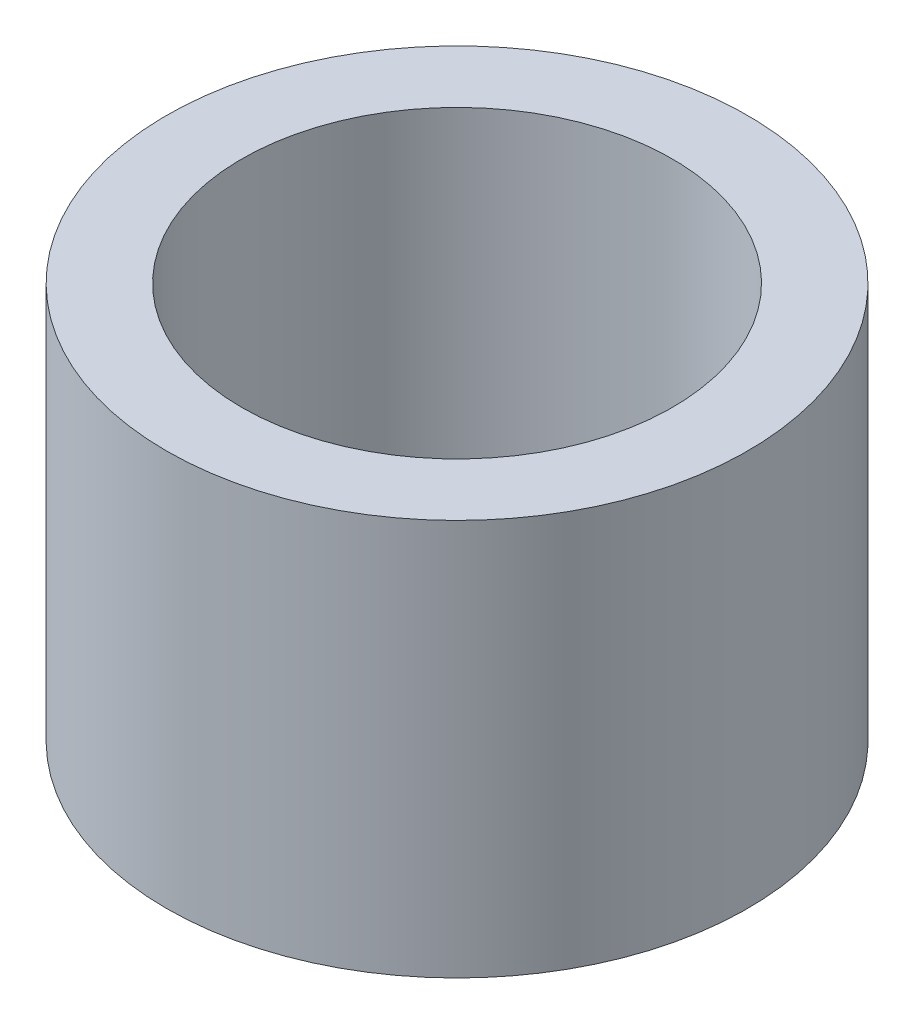
ISO-10303-21;
HEADER;
FILE_DESCRIPTION(('STEP AP214'),'2;1');
FILE_NAME('part.step','',(''),(''),'','','');
FILE_SCHEMA(('AUTOMOTIVE_DESIGN { 1 0 10303 214 1 1 1 1 }'));
ENDSEC;
DATA;
#1=APPLICATION_CONTEXT('core data for automotive mechanical design processes');
#2=APPLICATION_PROTOCOL_DEFINITION('international standard','automotive_design',2000,#1);
#3=PRODUCT_CONTEXT('',#1,'mechanical');
#4=PRODUCT('Part','Part','',(#3));
#5=PRODUCT_RELATED_PRODUCT_CATEGORY('part','',(#4));
#6=PRODUCT_DEFINITION_FORMATION('','',#4);
#7=PRODUCT_DEFINITION_CONTEXT('part definition',#1,'design');
#8=PRODUCT_DEFINITION('design','',#6,#7);
#9=PRODUCT_DEFINITION_SHAPE('','',#8);
#10=(LENGTH_UNIT() NAMED_UNIT(*) SI_UNIT(.MILLI.,.METRE.));
#11=(NAMED_UNIT(*) PLANE_ANGLE_UNIT() SI_UNIT($,.RADIAN.));
#12=(NAMED_UNIT(*) SI_UNIT($,.STERADIAN.) SOLID_ANGLE_UNIT());
#13=UNCERTAINTY_MEASURE_WITH_UNIT(LENGTH_MEASURE(1.E-05),#10,'distance_accuracy_value','');
#14=(GEOMETRIC_REPRESENTATION_CONTEXT(3) GLOBAL_UNCERTAINTY_ASSIGNED_CONTEXT((#13)) GLOBAL_UNIT_ASSIGNED_CONTEXT((#10,
#11,#12)) REPRESENTATION_CONTEXT('',''));
#15=CARTESIAN_POINT('',(0.,0.,0.));
#16=DIRECTION('',(0.,0.,1.));
#17=DIRECTION('',(1.,0.,0.));
#18=AXIS2_PLACEMENT_3D('',#15,#16,#17);
#19=CARTESIAN_POINT('',(0.,15.,0.));
#20=DIRECTION('',(0.,1.,0.));
#21=DIRECTION('',(0.,0.,1.));
#22=AXIS2_PLACEMENT_3D('',#19,#20,#21);
#23=PLANE('',#22);
#24=CARTESIAN_POINT('',(0.,15.,0.));
#25=DIRECTION('',(0.,1.,0.));
#26=DIRECTION('',(0.,0.,1.));
#27=AXIS2_PLACEMENT_3D('',#24,#25,#26);
#28=CIRCLE('',#27,11.);
#29=CARTESIAN_POINT('',(0.,15.,11.));
#30=VERTEX_POINT('',#29);
#31=EDGE_CURVE('E10',#30,#30,#28,.T.);
#32=ORIENTED_EDGE('',*,*,#31,.T.);
#33=EDGE_LOOP('',(#32));
#34=FACE_BOUND('',#33,.T.);
#35=CARTESIAN_POINT('',(0.,15.,0.));
#36=DIRECTION('',(0.,1.,0.));
#37=DIRECTION('',(0.,0.,1.));
#38=AXIS2_PLACEMENT_3D('',#35,#36,#37);
#39=CIRCLE('',#38,8.15);
#40=CARTESIAN_POINT('',(0.,15.,8.15));
#41=VERTEX_POINT('',#40);
#42=EDGE_CURVE('E43',#41,#41,#39,.T.);
#43=ORIENTED_EDGE('',*,*,#42,.F.);
#44=EDGE_LOOP('',(#43));
#45=FACE_BOUND('',#44,.T.);
#46=ADVANCED_FACE('F32',(#34,#45),#23,.T.);
#47=CARTESIAN_POINT('',(0.,0.,0.));
#48=DIRECTION('',(0.,1.,0.));
#49=DIRECTION('',(0.,0.,1.));
#50=AXIS2_PLACEMENT_3D('',#47,#48,#49);
#51=PLANE('',#50);
#52=CARTESIAN_POINT('',(0.,0.,0.));
#53=DIRECTION('',(0.,1.,0.));
#54=DIRECTION('',(0.,0.,1.));
#55=AXIS2_PLACEMENT_3D('',#52,#53,#54);
#56=CIRCLE('',#55,11.);
#57=CARTESIAN_POINT('',(0.,0.,11.));
#58=VERTEX_POINT('',#57);
#59=EDGE_CURVE('E36',#58,#58,#56,.T.);
#60=ORIENTED_EDGE('',*,*,#59,.F.);
#61=EDGE_LOOP('',(#60));
#62=FACE_BOUND('',#61,.T.);
#63=CARTESIAN_POINT('',(0.,0.,0.));
#64=DIRECTION('',(0.,1.,0.));
#65=DIRECTION('',(0.,0.,1.));
#66=AXIS2_PLACEMENT_3D('',#63,#64,#65);
#67=CIRCLE('',#66,8.15);
#68=CARTESIAN_POINT('',(0.,0.,8.15));
#69=VERTEX_POINT('',#68);
#70=EDGE_CURVE('E45',#69,#69,#67,.T.);
#71=ORIENTED_EDGE('',*,*,#70,.T.);
#72=EDGE_LOOP('',(#71));
#73=FACE_BOUND('',#72,.T.);
#74=ADVANCED_FACE('F55',(#62,#73),#51,.F.);
#75=CARTESIAN_POINT('',(0.,15.,0.));
#76=DIRECTION('',(0.,-1.,0.));
#77=DIRECTION('',(0.,0.,-1.));
#78=AXIS2_PLACEMENT_3D('',#75,#76,#77);
#79=CYLINDRICAL_SURFACE('',#78,11.);
#80=ORIENTED_EDGE('',*,*,#31,.F.);
#81=EDGE_LOOP('',(#80));
#82=FACE_BOUND('',#81,.T.);
#83=ORIENTED_EDGE('',*,*,#59,.T.);
#84=EDGE_LOOP('',(#83));
#85=FACE_BOUND('',#84,.T.);
#86=ADVANCED_FACE('F34',(#82,#85),#79,.T.);
#87=CARTESIAN_POINT('',(0.,15.,0.));
#88=DIRECTION('',(0.,-1.,0.));
#89=DIRECTION('',(0.,0.,-1.));
#90=AXIS2_PLACEMENT_3D('',#87,#88,#89);
#91=CYLINDRICAL_SURFACE('',#90,8.15);
#92=ORIENTED_EDGE('',*,*,#42,.T.);
#93=EDGE_LOOP('',(#92));
#94=FACE_BOUND('',#93,.T.);
#95=ORIENTED_EDGE('',*,*,#70,.F.);
#96=EDGE_LOOP('',(#95));
#97=FACE_BOUND('',#96,.T.);
#98=ADVANCED_FACE('F51',(#94,#97),#91,.F.);
#99=CLOSED_SHELL('',(#46,#74,#86,#98));
#100=MANIFOLD_SOLID_BREP('B2',#99);
#101=ADVANCED_BREP_SHAPE_REPRESENTATION('',(#18,#100),#14);
#102=SHAPE_DEFINITION_REPRESENTATION(#9,#101);
ENDSEC;
END-ISO-10303-21;
